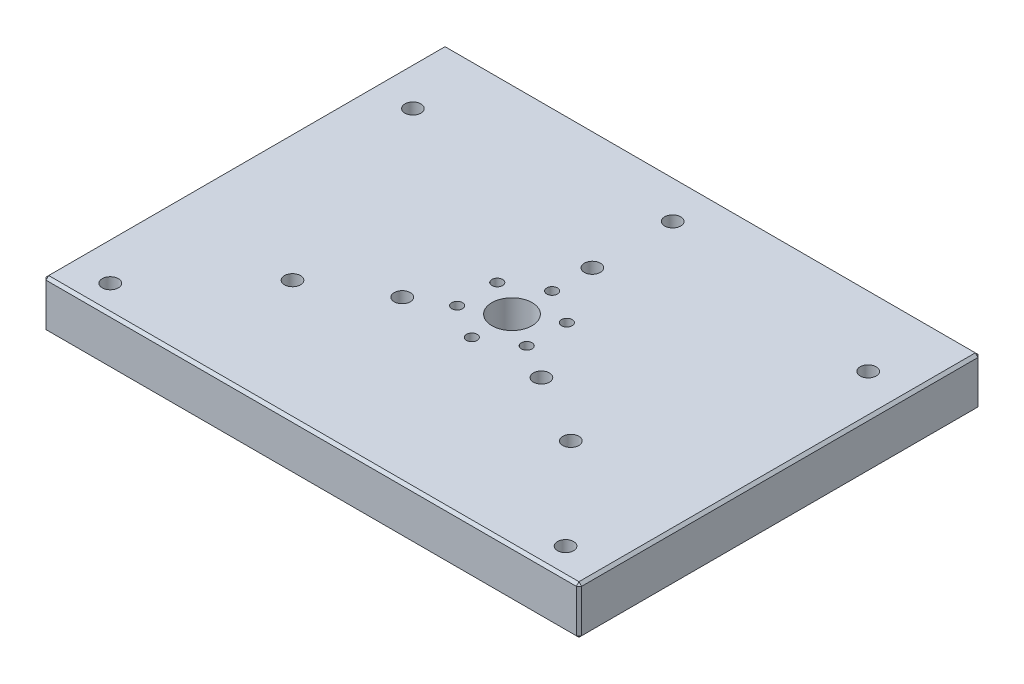
ISO-10303-21;
HEADER;
FILE_DESCRIPTION(('STEP AP214'),'2;1');
FILE_NAME('part.step','',(''),(''),'','','');
FILE_SCHEMA(('AUTOMOTIVE_DESIGN { 1 0 10303 214 1 1 1 1 }'));
ENDSEC;
DATA;
#1=APPLICATION_CONTEXT('core data for automotive mechanical design processes');
#2=APPLICATION_PROTOCOL_DEFINITION('international standard','automotive_design',2000,#1);
#3=PRODUCT_CONTEXT('',#1,'mechanical');
#4=PRODUCT('Part','Part','',(#3));
#5=PRODUCT_RELATED_PRODUCT_CATEGORY('part','',(#4));
#6=PRODUCT_DEFINITION_FORMATION('','',#4);
#7=PRODUCT_DEFINITION_CONTEXT('part definition',#1,'design');
#8=PRODUCT_DEFINITION('design','',#6,#7);
#9=PRODUCT_DEFINITION_SHAPE('','',#8);
#10=(LENGTH_UNIT() NAMED_UNIT(*) SI_UNIT(.MILLI.,.METRE.));
#11=(NAMED_UNIT(*) PLANE_ANGLE_UNIT() SI_UNIT($,.RADIAN.));
#12=(NAMED_UNIT(*) SI_UNIT($,.STERADIAN.) SOLID_ANGLE_UNIT());
#13=UNCERTAINTY_MEASURE_WITH_UNIT(LENGTH_MEASURE(1.E-05),#10,'distance_accuracy_value','');
#14=(GEOMETRIC_REPRESENTATION_CONTEXT(3) GLOBAL_UNCERTAINTY_ASSIGNED_CONTEXT((#13)) GLOBAL_UNIT_ASSIGNED_CONTEXT((#10,
#11,#12)) REPRESENTATION_CONTEXT('',''));
#15=CARTESIAN_POINT('',(0.,0.,0.));
#16=DIRECTION('',(0.,0.,1.));
#17=DIRECTION('',(1.,0.,0.));
#18=AXIS2_PLACEMENT_3D('',#15,#16,#17);
#19=CARTESIAN_POINT('',(100.,-10.,-75.));
#20=DIRECTION('',(1.,0.,0.));
#21=DIRECTION('',(0.,0.,-1.));
#22=AXIS2_PLACEMENT_3D('',#19,#20,#21);
#23=PLANE('',#22);
#24=DIRECTION('',(0.,0.,-1.));
#25=VECTOR('',#24,1.);
#26=CARTESIAN_POINT('',(100.,-9.,-75.));
#27=LINE('',#26,#25);
#28=CARTESIAN_POINT('',(100.,-9.,74.));
#29=VERTEX_POINT('',#28);
#30=CARTESIAN_POINT('',(100.,-9.,-74.));
#31=VERTEX_POINT('',#30);
#32=EDGE_CURVE('E135',#29,#31,#27,.T.);
#33=ORIENTED_EDGE('',*,*,#32,.T.);
#34=DIRECTION('',(0.,1.,0.));
#35=VECTOR('',#34,1.);
#36=CARTESIAN_POINT('',(100.,-10.,-74.));
#37=LINE('',#36,#35);
#38=CARTESIAN_POINT('',(100.,7.,-74.));
#39=VERTEX_POINT('',#38);
#40=EDGE_CURVE('E131',#31,#39,#37,.T.);
#41=ORIENTED_EDGE('',*,*,#40,.T.);
#42=DIRECTION('',(0.,0.,1.));
#43=VECTOR('',#42,1.);
#44=CARTESIAN_POINT('',(100.,7.,-75.));
#45=LINE('',#44,#43);
#46=CARTESIAN_POINT('',(100.,7.,74.));
#47=VERTEX_POINT('',#46);
#48=EDGE_CURVE('E126',#39,#47,#45,.T.);
#49=ORIENTED_EDGE('',*,*,#48,.T.);
#50=DIRECTION('',(0.,-1.,0.));
#51=VECTOR('',#50,1.);
#52=CARTESIAN_POINT('',(100.,-10.,74.));
#53=LINE('',#52,#51);
#54=EDGE_CURVE('E128',#47,#29,#53,.T.);
#55=ORIENTED_EDGE('',*,*,#54,.T.);
#56=EDGE_LOOP('',(#33,#41,#49,#55));
#57=FACE_BOUND('',#56,.T.);
#58=ADVANCED_FACE('F37',(#57),#23,.T.);
#59=CARTESIAN_POINT('',(-100.,-10.,75.));
#60=DIRECTION('',(0.,0.,1.));
#61=DIRECTION('',(1.,0.,0.));
#62=AXIS2_PLACEMENT_3D('',#59,#60,#61);
#63=PLANE('',#62);
#64=DIRECTION('',(1.,0.,0.));
#65=VECTOR('',#64,1.);
#66=CARTESIAN_POINT('',(100.,-9.,75.));
#67=LINE('',#66,#65);
#68=CARTESIAN_POINT('',(-99.,-9.,75.));
#69=VERTEX_POINT('',#68);
#70=CARTESIAN_POINT('',(99.,-9.,75.));
#71=VERTEX_POINT('',#70);
#72=EDGE_CURVE('E344',#69,#71,#67,.T.);
#73=ORIENTED_EDGE('',*,*,#72,.T.);
#74=DIRECTION('',(0.,1.,0.));
#75=VECTOR('',#74,1.);
#76=CARTESIAN_POINT('',(99.,-10.,75.));
#77=LINE('',#76,#75);
#78=CARTESIAN_POINT('',(99.,7.,75.));
#79=VERTEX_POINT('',#78);
#80=EDGE_CURVE('E346',#71,#79,#77,.T.);
#81=ORIENTED_EDGE('',*,*,#80,.T.);
#82=DIRECTION('',(-1.,0.,0.));
#83=VECTOR('',#82,1.);
#84=CARTESIAN_POINT('',(-100.,7.,75.));
#85=LINE('',#84,#83);
#86=CARTESIAN_POINT('',(-99.,7.,75.));
#87=VERTEX_POINT('',#86);
#88=EDGE_CURVE('E342',#79,#87,#85,.T.);
#89=ORIENTED_EDGE('',*,*,#88,.T.);
#90=DIRECTION('',(0.,-1.,0.));
#91=VECTOR('',#90,1.);
#92=CARTESIAN_POINT('',(-99.,-10.,75.));
#93=LINE('',#92,#91);
#94=EDGE_CURVE('E340',#87,#69,#93,.T.);
#95=ORIENTED_EDGE('',*,*,#94,.T.);
#96=EDGE_LOOP('',(#73,#81,#89,#95));
#97=FACE_BOUND('',#96,.T.);
#98=ADVANCED_FACE('F400',(#97),#63,.T.);
#99=CARTESIAN_POINT('',(-100.,-10.,-75.));
#100=DIRECTION('',(-1.,0.,0.));
#101=DIRECTION('',(0.,0.,1.));
#102=AXIS2_PLACEMENT_3D('',#99,#100,#101);
#103=PLANE('',#102);
#104=DIRECTION('',(0.,0.,1.));
#105=VECTOR('',#104,1.);
#106=CARTESIAN_POINT('',(-100.,-9.,75.));
#107=LINE('',#106,#105);
#108=CARTESIAN_POINT('',(-100.,-9.,-74.));
#109=VERTEX_POINT('',#108);
#110=CARTESIAN_POINT('',(-100.,-9.,74.));
#111=VERTEX_POINT('',#110);
#112=EDGE_CURVE('E349',#109,#111,#107,.T.);
#113=ORIENTED_EDGE('',*,*,#112,.T.);
#114=DIRECTION('',(0.,1.,0.));
#115=VECTOR('',#114,1.);
#116=CARTESIAN_POINT('',(-100.,-10.,74.));
#117=LINE('',#116,#115);
#118=CARTESIAN_POINT('',(-100.,7.,74.));
#119=VERTEX_POINT('',#118);
#120=EDGE_CURVE('E11',#111,#119,#117,.T.);
#121=ORIENTED_EDGE('',*,*,#120,.T.);
#122=DIRECTION('',(0.,0.,-1.));
#123=VECTOR('',#122,1.);
#124=CARTESIAN_POINT('',(-100.,7.,-75.));
#125=LINE('',#124,#123);
#126=CARTESIAN_POINT('',(-100.,7.,-74.));
#127=VERTEX_POINT('',#126);
#128=EDGE_CURVE('E46',#119,#127,#125,.T.);
#129=ORIENTED_EDGE('',*,*,#128,.T.);
#130=DIRECTION('',(0.,-1.,0.));
#131=VECTOR('',#130,1.);
#132=CARTESIAN_POINT('',(-100.,-10.,-74.));
#133=LINE('',#132,#131);
#134=EDGE_CURVE('E351',#127,#109,#133,.T.);
#135=ORIENTED_EDGE('',*,*,#134,.T.);
#136=EDGE_LOOP('',(#113,#121,#129,#135));
#137=FACE_BOUND('',#136,.T.);
#138=ADVANCED_FACE('F443',(#137),#103,.T.);
#139=CARTESIAN_POINT('',(-100.,-10.,-75.));
#140=DIRECTION('',(0.,0.,-1.));
#141=DIRECTION('',(-1.,0.,0.));
#142=AXIS2_PLACEMENT_3D('',#139,#140,#141);
#143=PLANE('',#142);
#144=DIRECTION('',(1.,0.,0.));
#145=VECTOR('',#144,1.);
#146=CARTESIAN_POINT('',(-100.,7.,-75.));
#147=LINE('',#146,#145);
#148=CARTESIAN_POINT('',(-99.,7.,-75.));
#149=VERTEX_POINT('',#148);
#150=CARTESIAN_POINT('',(99.,7.,-75.));
#151=VERTEX_POINT('',#150);
#152=EDGE_CURVE('E319',#149,#151,#147,.T.);
#153=ORIENTED_EDGE('',*,*,#152,.T.);
#154=DIRECTION('',(0.,-1.,0.));
#155=VECTOR('',#154,1.);
#156=CARTESIAN_POINT('',(99.,-10.,-75.));
#157=LINE('',#156,#155);
#158=CARTESIAN_POINT('',(99.,-9.,-75.));
#159=VERTEX_POINT('',#158);
#160=EDGE_CURVE('E321',#151,#159,#157,.T.);
#161=ORIENTED_EDGE('',*,*,#160,.T.);
#162=DIRECTION('',(-1.,0.,0.));
#163=VECTOR('',#162,1.);
#164=CARTESIAN_POINT('',(-100.,-9.,-75.));
#165=LINE('',#164,#163);
#166=CARTESIAN_POINT('',(-99.,-9.,-75.));
#167=VERTEX_POINT('',#166);
#168=EDGE_CURVE('E315',#159,#167,#165,.T.);
#169=ORIENTED_EDGE('',*,*,#168,.T.);
#170=DIRECTION('',(0.,1.,0.));
#171=VECTOR('',#170,1.);
#172=CARTESIAN_POINT('',(-99.,-10.,-75.));
#173=LINE('',#172,#171);
#174=EDGE_CURVE('E317',#167,#149,#173,.T.);
#175=ORIENTED_EDGE('',*,*,#174,.T.);
#176=EDGE_LOOP('',(#153,#161,#169,#175));
#177=FACE_BOUND('',#176,.T.);
#178=ADVANCED_FACE('F379',(#177),#143,.T.);
#179=CARTESIAN_POINT('',(0.,-10.,0.));
#180=DIRECTION('',(0.,1.,0.));
#181=DIRECTION('',(0.,0.,1.));
#182=AXIS2_PLACEMENT_3D('',#179,#180,#181);
#183=PLANE('',#182);
#184=DIRECTION('',(1.,0.,0.));
#185=VECTOR('',#184,1.);
#186=CARTESIAN_POINT('',(100.,-10.,-74.));
#187=LINE('',#186,#185);
#188=CARTESIAN_POINT('',(-99.,-10.,-74.));
#189=VERTEX_POINT('',#188);
#190=CARTESIAN_POINT('',(99.,-10.,-74.));
#191=VERTEX_POINT('',#190);
#192=EDGE_CURVE('E326',#189,#191,#187,.T.);
#193=ORIENTED_EDGE('',*,*,#192,.T.);
#194=DIRECTION('',(0.,0.,1.));
#195=VECTOR('',#194,1.);
#196=CARTESIAN_POINT('',(99.,-10.,75.));
#197=LINE('',#196,#195);
#198=CARTESIAN_POINT('',(99.,-10.,74.));
#199=VERTEX_POINT('',#198);
#200=EDGE_CURVE('E330',#191,#199,#197,.T.);
#201=ORIENTED_EDGE('',*,*,#200,.T.);
#202=DIRECTION('',(-1.,0.,0.));
#203=VECTOR('',#202,1.);
#204=CARTESIAN_POINT('',(-100.,-10.,74.));
#205=LINE('',#204,#203);
#206=CARTESIAN_POINT('',(-99.,-10.,74.));
#207=VERTEX_POINT('',#206);
#208=EDGE_CURVE('E328',#199,#207,#205,.T.);
#209=ORIENTED_EDGE('',*,*,#208,.T.);
#210=DIRECTION('',(0.,0.,-1.));
#211=VECTOR('',#210,1.);
#212=CARTESIAN_POINT('',(-99.,-10.,-75.));
#213=LINE('',#212,#211);
#214=EDGE_CURVE('E324',#207,#189,#213,.T.);
#215=ORIENTED_EDGE('',*,*,#214,.T.);
#216=EDGE_LOOP('',(#193,#201,#209,#215));
#217=FACE_BOUND('',#216,.T.);
#218=CARTESIAN_POINT('',(8.39606162372775E-13,-10.,-60.));
#219=DIRECTION('',(0.,1.,0.));
#220=DIRECTION('',(0.,0.,1.));
#221=AXIS2_PLACEMENT_3D('',#218,#219,#220);
#222=CIRCLE('',#221,3.);
#223=CARTESIAN_POINT('',(8.39606162372775E-13,-10.,-57.));
#224=VERTEX_POINT('',#223);
#225=EDGE_CURVE('E211',#224,#224,#222,.T.);
#226=ORIENTED_EDGE('',*,*,#225,.T.);
#227=EDGE_LOOP('',(#226));
#228=FACE_BOUND('',#227,.T.);
#229=CARTESIAN_POINT('',(-85.,-10.,-48.));
#230=DIRECTION('',(0.,1.,0.));
#231=DIRECTION('',(0.,0.,-1.));
#232=AXIS2_PLACEMENT_3D('',#229,#230,#231);
#233=CIRCLE('',#232,3.00000000000001);
#234=CARTESIAN_POINT('',(-85.,-10.,-51.));
#235=VERTEX_POINT('',#234);
#236=EDGE_CURVE('E216',#235,#235,#233,.T.);
#237=ORIENTED_EDGE('',*,*,#236,.T.);
#238=EDGE_LOOP('',(#237));
#239=FACE_BOUND('',#238,.T.);
#240=CARTESIAN_POINT('',(-85.,-10.,65.));
#241=DIRECTION('',(0.,1.,0.));
#242=DIRECTION('',(0.,0.,-1.));
#243=AXIS2_PLACEMENT_3D('',#240,#241,#242);
#244=CIRCLE('',#243,3.00000000000001);
#245=CARTESIAN_POINT('',(-85.,-10.,62.));
#246=VERTEX_POINT('',#245);
#247=EDGE_CURVE('E223',#246,#246,#244,.T.);
#248=ORIENTED_EDGE('',*,*,#247,.T.);
#249=EDGE_LOOP('',(#248));
#250=FACE_BOUND('',#249,.T.);
#251=CARTESIAN_POINT('',(-51.9615242270666,-10.,29.9999999999995));
#252=DIRECTION('',(0.,1.,0.));
#253=DIRECTION('',(0.,0.,1.));
#254=AXIS2_PLACEMENT_3D('',#251,#252,#253);
#255=CIRCLE('',#254,2.99999999999999);
#256=CARTESIAN_POINT('',(-51.9615242270666,-10.,32.9999999999995));
#257=VERTEX_POINT('',#256);
#258=EDGE_CURVE('E219',#257,#257,#255,.T.);
#259=ORIENTED_EDGE('',*,*,#258,.T.);
#260=EDGE_LOOP('',(#259));
#261=FACE_BOUND('',#260,.T.);
#262=CARTESIAN_POINT('',(85.,-10.,65.));
#263=DIRECTION('',(0.,1.,0.));
#264=DIRECTION('',(0.,0.,1.));
#265=AXIS2_PLACEMENT_3D('',#262,#263,#264);
#266=CIRCLE('',#265,3.00000000000001);
#267=CARTESIAN_POINT('',(85.,-10.,68.));
#268=VERTEX_POINT('',#267);
#269=EDGE_CURVE('E222',#268,#268,#266,.T.);
#270=ORIENTED_EDGE('',*,*,#269,.T.);
#271=EDGE_LOOP('',(#270));
#272=FACE_BOUND('',#271,.T.);
#273=CARTESIAN_POINT('',(25.980762113533,-10.,15.0000000000002));
#274=DIRECTION('',(0.,1.,0.));
#275=DIRECTION('',(0.,0.,1.));
#276=AXIS2_PLACEMENT_3D('',#273,#274,#275);
#277=CIRCLE('',#276,2.99999999999999);
#278=CARTESIAN_POINT('',(25.980762113533,-10.,18.0000000000002));
#279=VERTEX_POINT('',#278);
#280=EDGE_CURVE('E235',#279,#279,#277,.T.);
#281=ORIENTED_EDGE('',*,*,#280,.T.);
#282=EDGE_LOOP('',(#281));
#283=FACE_BOUND('',#282,.T.);
#284=CARTESIAN_POINT('',(2.7580761951353E-13,-10.,-30.));
#285=DIRECTION('',(0.,1.,0.));
#286=DIRECTION('',(0.,0.,1.));
#287=AXIS2_PLACEMENT_3D('',#284,#285,#286);
#288=CIRCLE('',#287,2.99999999999999);
#289=CARTESIAN_POINT('',(2.7580761951353E-13,-10.,-27.));
#290=VERTEX_POINT('',#289);
#291=EDGE_CURVE('E232',#290,#290,#288,.T.);
#292=ORIENTED_EDGE('',*,*,#291,.T.);
#293=EDGE_LOOP('',(#292));
#294=FACE_BOUND('',#293,.T.);
#295=CARTESIAN_POINT('',(-25.9807621135333,-10.,14.9999999999998));
#296=DIRECTION('',(0.,1.,0.));
#297=DIRECTION('',(0.,0.,1.));
#298=AXIS2_PLACEMENT_3D('',#295,#296,#297);
#299=CIRCLE('',#298,2.99999999999999);
#300=CARTESIAN_POINT('',(-25.9807621135333,-10.,17.9999999999998));
#301=VERTEX_POINT('',#300);
#302=EDGE_CURVE('E228',#301,#301,#299,.T.);
#303=ORIENTED_EDGE('',*,*,#302,.T.);
#304=EDGE_LOOP('',(#303));
#305=FACE_BOUND('',#304,.T.);
#306=CARTESIAN_POINT('',(51.9615242270658,-10.,30.000000000001));
#307=DIRECTION('',(0.,1.,0.));
#308=DIRECTION('',(0.,0.,1.));
#309=AXIS2_PLACEMENT_3D('',#306,#307,#308);
#310=CIRCLE('',#309,3.);
#311=CARTESIAN_POINT('',(51.9615242270658,-10.,33.000000000001));
#312=VERTEX_POINT('',#311);
#313=EDGE_CURVE('E205',#312,#312,#310,.T.);
#314=ORIENTED_EDGE('',*,*,#313,.T.);
#315=EDGE_LOOP('',(#314));
#316=FACE_BOUND('',#315,.T.);
#317=CARTESIAN_POINT('',(85.,-10.,-48.));
#318=DIRECTION('',(0.,1.,0.));
#319=DIRECTION('',(0.,0.,1.));
#320=AXIS2_PLACEMENT_3D('',#317,#318,#319);
#321=CIRCLE('',#320,3.00000000000001);
#322=CARTESIAN_POINT('',(85.,-10.,-45.));
#323=VERTEX_POINT('',#322);
#324=EDGE_CURVE('E231',#323,#323,#321,.T.);
#325=ORIENTED_EDGE('',*,*,#324,.T.);
#326=EDGE_LOOP('',(#325));
#327=FACE_BOUND('',#326,.T.);
#328=CARTESIAN_POINT('',(-12.9903810567665,-10.,-7.50000000000015));
#329=DIRECTION('',(0.,1.,0.));
#330=DIRECTION('',(0.,0.,1.));
#331=AXIS2_PLACEMENT_3D('',#328,#329,#330);
#332=CIRCLE('',#331,2.);
#333=CARTESIAN_POINT('',(-12.9903810567665,-10.,-5.50000000000015));
#334=VERTEX_POINT('',#333);
#335=EDGE_CURVE('E265',#334,#334,#332,.T.);
#336=ORIENTED_EDGE('',*,*,#335,.T.);
#337=EDGE_LOOP('',(#336));
#338=FACE_BOUND('',#337,.T.);
#339=CARTESIAN_POINT('',(-12.9903810567667,-10.,7.49999999999988));
#340=DIRECTION('',(0.,1.,0.));
#341=DIRECTION('',(0.,0.,1.));
#342=AXIS2_PLACEMENT_3D('',#339,#340,#341);
#343=CIRCLE('',#342,2.);
#344=CARTESIAN_POINT('',(-12.9903810567667,-10.,9.49999999999988));
#345=VERTEX_POINT('',#344);
#346=EDGE_CURVE('E268',#345,#345,#343,.T.);
#347=ORIENTED_EDGE('',*,*,#346,.T.);
#348=EDGE_LOOP('',(#347));
#349=FACE_BOUND('',#348,.T.);
#350=CARTESIAN_POINT('',(-1.04744440165294E-13,-10.,15.));
#351=DIRECTION('',(0.,1.,0.));
#352=DIRECTION('',(0.,0.,1.));
#353=AXIS2_PLACEMENT_3D('',#350,#351,#352);
#354=CIRCLE('',#353,2.);
#355=CARTESIAN_POINT('',(-1.04744440165294E-13,-10.,17.));
#356=VERTEX_POINT('',#355);
#357=EDGE_CURVE('E271',#356,#356,#354,.T.);
#358=ORIENTED_EDGE('',*,*,#357,.T.);
#359=EDGE_LOOP('',(#358));
#360=FACE_BOUND('',#359,.T.);
#361=CARTESIAN_POINT('',(12.9903810567665,-10.,7.50000000000006));
#362=DIRECTION('',(0.,1.,0.));
#363=DIRECTION('',(0.,0.,1.));
#364=AXIS2_PLACEMENT_3D('',#361,#362,#363);
#365=CIRCLE('',#364,2.);
#366=CARTESIAN_POINT('',(12.9903810567665,-10.,9.50000000000006));
#367=VERTEX_POINT('',#366);
#368=EDGE_CURVE('E274',#367,#367,#365,.T.);
#369=ORIENTED_EDGE('',*,*,#368,.T.);
#370=EDGE_LOOP('',(#369));
#371=FACE_BOUND('',#370,.T.);
#372=CARTESIAN_POINT('',(12.9903810567666,-10.,-7.49999999999997));
#373=DIRECTION('',(0.,1.,0.));
#374=DIRECTION('',(0.,0.,1.));
#375=AXIS2_PLACEMENT_3D('',#372,#373,#374);
#376=CIRCLE('',#375,2.);
#377=CARTESIAN_POINT('',(12.9903810567666,-10.,-5.49999999999997));
#378=VERTEX_POINT('',#377);
#379=EDGE_CURVE('E277',#378,#378,#376,.T.);
#380=ORIENTED_EDGE('',*,*,#379,.T.);
#381=EDGE_LOOP('',(#380));
#382=FACE_BOUND('',#381,.T.);
#383=CARTESIAN_POINT('',(0.,-10.,-15.));
#384=DIRECTION('',(0.,1.,0.));
#385=DIRECTION('',(0.,0.,1.));
#386=AXIS2_PLACEMENT_3D('',#383,#384,#385);
#387=CIRCLE('',#386,2.);
#388=CARTESIAN_POINT('',(0.,-10.,-13.));
#389=VERTEX_POINT('',#388);
#390=EDGE_CURVE('E280',#389,#389,#387,.T.);
#391=ORIENTED_EDGE('',*,*,#390,.T.);
#392=EDGE_LOOP('',(#391));
#393=FACE_BOUND('',#392,.T.);
#394=CARTESIAN_POINT('',(0.,-10.,0.));
#395=DIRECTION('',(0.,1.,0.));
#396=DIRECTION('',(0.,0.,1.));
#397=AXIS2_PLACEMENT_3D('',#394,#395,#396);
#398=CIRCLE('',#397,7.5);
#399=CARTESIAN_POINT('',(0.,-10.,7.50000000000001));
#400=VERTEX_POINT('',#399);
#401=EDGE_CURVE('E147',#400,#400,#398,.T.);
#402=ORIENTED_EDGE('',*,*,#401,.T.);
#403=EDGE_LOOP('',(#402));
#404=FACE_BOUND('',#403,.T.);
#405=ADVANCED_FACE('F413',(#217,#228,#239,#250,#261,#272,#283,#294,#305,#316,#327,#338,#349,
#360,#371,#382,#393,#404),#183,.F.);
#406=CARTESIAN_POINT('',(0.,-10.,0.));
#407=DIRECTION('',(0.,1.,0.));
#408=DIRECTION('',(0.,0.,1.));
#409=AXIS2_PLACEMENT_3D('',#406,#407,#408);
#410=CYLINDRICAL_SURFACE('',#409,7.5);
#411=ORIENTED_EDGE('',*,*,#401,.F.);
#412=EDGE_LOOP('',(#411));
#413=FACE_BOUND('',#412,.T.);
#414=CARTESIAN_POINT('',(0.,8.,0.));
#415=DIRECTION('',(0.,1.,0.));
#416=DIRECTION('',(0.,0.,1.));
#417=AXIS2_PLACEMENT_3D('',#414,#415,#416);
#418=CIRCLE('',#417,7.5);
#419=CARTESIAN_POINT('',(0.,8.,7.50000000000001));
#420=VERTEX_POINT('',#419);
#421=EDGE_CURVE('E262',#420,#420,#418,.T.);
#422=ORIENTED_EDGE('',*,*,#421,.T.);
#423=EDGE_LOOP('',(#422));
#424=FACE_BOUND('',#423,.T.);
#425=ADVANCED_FACE('F747',(#413,#424),#410,.F.);
#426=CARTESIAN_POINT('',(0.,-10.,-15.));
#427=DIRECTION('',(0.,1.,0.));
#428=DIRECTION('',(0.,0.,1.));
#429=AXIS2_PLACEMENT_3D('',#426,#427,#428);
#430=CYLINDRICAL_SURFACE('',#429,2.);
#431=ORIENTED_EDGE('',*,*,#390,.F.);
#432=EDGE_LOOP('',(#431));
#433=FACE_BOUND('',#432,.T.);
#434=CARTESIAN_POINT('',(0.,8.,-15.));
#435=DIRECTION('',(0.,1.,0.));
#436=DIRECTION('',(0.,0.,1.));
#437=AXIS2_PLACEMENT_3D('',#434,#435,#436);
#438=CIRCLE('',#437,2.);
#439=CARTESIAN_POINT('',(0.,8.,-13.));
#440=VERTEX_POINT('',#439);
#441=EDGE_CURVE('E259',#440,#440,#438,.T.);
#442=ORIENTED_EDGE('',*,*,#441,.T.);
#443=EDGE_LOOP('',(#442));
#444=FACE_BOUND('',#443,.T.);
#445=ADVANCED_FACE('F738',(#433,#444),#430,.F.);
#446=CARTESIAN_POINT('',(12.9903810567666,-10.,-7.49999999999997));
#447=DIRECTION('',(0.,1.,0.));
#448=DIRECTION('',(0.,0.,1.));
#449=AXIS2_PLACEMENT_3D('',#446,#447,#448);
#450=CYLINDRICAL_SURFACE('',#449,2.);
#451=ORIENTED_EDGE('',*,*,#379,.F.);
#452=EDGE_LOOP('',(#451));
#453=FACE_BOUND('',#452,.T.);
#454=CARTESIAN_POINT('',(12.9903810567666,8.,-7.49999999999997));
#455=DIRECTION('',(0.,1.,0.));
#456=DIRECTION('',(0.,0.,1.));
#457=AXIS2_PLACEMENT_3D('',#454,#455,#456);
#458=CIRCLE('',#457,2.);
#459=CARTESIAN_POINT('',(12.9903810567666,8.,-5.49999999999997));
#460=VERTEX_POINT('',#459);
#461=EDGE_CURVE('E256',#460,#460,#458,.T.);
#462=ORIENTED_EDGE('',*,*,#461,.T.);
#463=EDGE_LOOP('',(#462));
#464=FACE_BOUND('',#463,.T.);
#465=ADVANCED_FACE('F729',(#453,#464),#450,.F.);
#466=CARTESIAN_POINT('',(12.9903810567665,-10.,7.50000000000006));
#467=DIRECTION('',(0.,1.,0.));
#468=DIRECTION('',(0.,0.,1.));
#469=AXIS2_PLACEMENT_3D('',#466,#467,#468);
#470=CYLINDRICAL_SURFACE('',#469,2.);
#471=ORIENTED_EDGE('',*,*,#368,.F.);
#472=EDGE_LOOP('',(#471));
#473=FACE_BOUND('',#472,.T.);
#474=CARTESIAN_POINT('',(12.9903810567665,8.,7.50000000000006));
#475=DIRECTION('',(0.,1.,0.));
#476=DIRECTION('',(0.,0.,1.));
#477=AXIS2_PLACEMENT_3D('',#474,#475,#476);
#478=CIRCLE('',#477,2.);
#479=CARTESIAN_POINT('',(12.9903810567665,8.,9.50000000000006));
#480=VERTEX_POINT('',#479);
#481=EDGE_CURVE('E253',#480,#480,#478,.T.);
#482=ORIENTED_EDGE('',*,*,#481,.T.);
#483=EDGE_LOOP('',(#482));
#484=FACE_BOUND('',#483,.T.);
#485=ADVANCED_FACE('F720',(#473,#484),#470,.F.);
#486=CARTESIAN_POINT('',(-1.04744440165294E-13,-10.,15.));
#487=DIRECTION('',(0.,1.,0.));
#488=DIRECTION('',(0.,0.,1.));
#489=AXIS2_PLACEMENT_3D('',#486,#487,#488);
#490=CYLINDRICAL_SURFACE('',#489,2.);
#491=ORIENTED_EDGE('',*,*,#357,.F.);
#492=EDGE_LOOP('',(#491));
#493=FACE_BOUND('',#492,.T.);
#494=CARTESIAN_POINT('',(-1.04744440165294E-13,8.,15.));
#495=DIRECTION('',(0.,1.,0.));
#496=DIRECTION('',(0.,0.,1.));
#497=AXIS2_PLACEMENT_3D('',#494,#495,#496);
#498=CIRCLE('',#497,2.);
#499=CARTESIAN_POINT('',(-1.04744440165294E-13,8.,17.));
#500=VERTEX_POINT('',#499);
#501=EDGE_CURVE('E250',#500,#500,#498,.T.);
#502=ORIENTED_EDGE('',*,*,#501,.T.);
#503=EDGE_LOOP('',(#502));
#504=FACE_BOUND('',#503,.T.);
#505=ADVANCED_FACE('F711',(#493,#504),#490,.F.);
#506=CARTESIAN_POINT('',(-12.9903810567667,-10.,7.49999999999988));
#507=DIRECTION('',(0.,1.,0.));
#508=DIRECTION('',(0.,0.,1.));
#509=AXIS2_PLACEMENT_3D('',#506,#507,#508);
#510=CYLINDRICAL_SURFACE('',#509,2.);
#511=ORIENTED_EDGE('',*,*,#346,.F.);
#512=EDGE_LOOP('',(#511));
#513=FACE_BOUND('',#512,.T.);
#514=CARTESIAN_POINT('',(-12.9903810567667,8.,7.49999999999988));
#515=DIRECTION('',(0.,1.,0.));
#516=DIRECTION('',(0.,0.,1.));
#517=AXIS2_PLACEMENT_3D('',#514,#515,#516);
#518=CIRCLE('',#517,2.);
#519=CARTESIAN_POINT('',(-12.9903810567667,8.,9.49999999999988));
#520=VERTEX_POINT('',#519);
#521=EDGE_CURVE('E246',#520,#520,#518,.T.);
#522=ORIENTED_EDGE('',*,*,#521,.T.);
#523=EDGE_LOOP('',(#522));
#524=FACE_BOUND('',#523,.T.);
#525=ADVANCED_FACE('F702',(#513,#524),#510,.F.);
#526=CARTESIAN_POINT('',(-12.9903810567665,-10.,-7.50000000000015));
#527=DIRECTION('',(0.,1.,0.));
#528=DIRECTION('',(0.,0.,1.));
#529=AXIS2_PLACEMENT_3D('',#526,#527,#528);
#530=CYLINDRICAL_SURFACE('',#529,2.);
#531=ORIENTED_EDGE('',*,*,#335,.F.);
#532=EDGE_LOOP('',(#531));
#533=FACE_BOUND('',#532,.T.);
#534=CARTESIAN_POINT('',(-12.9903810567665,8.,-7.50000000000015));
#535=DIRECTION('',(0.,1.,0.));
#536=DIRECTION('',(0.,0.,1.));
#537=AXIS2_PLACEMENT_3D('',#534,#535,#536);
#538=CIRCLE('',#537,2.);
#539=CARTESIAN_POINT('',(-12.9903810567665,8.,-5.50000000000015));
#540=VERTEX_POINT('',#539);
#541=EDGE_CURVE('E243',#540,#540,#538,.T.);
#542=ORIENTED_EDGE('',*,*,#541,.T.);
#543=EDGE_LOOP('',(#542));
#544=FACE_BOUND('',#543,.T.);
#545=ADVANCED_FACE('F694',(#533,#544),#530,.F.);
#546=CARTESIAN_POINT('',(0.,8.,0.));
#547=DIRECTION('',(0.,1.,0.));
#548=DIRECTION('',(0.,0.,1.));
#549=AXIS2_PLACEMENT_3D('',#546,#547,#548);
#550=PLANE('',#549);
#551=DIRECTION('',(1.,0.,0.));
#552=VECTOR('',#551,1.);
#553=CARTESIAN_POINT('',(0.,8.,74.));
#554=LINE('',#553,#552);
#555=CARTESIAN_POINT('',(-99.,8.,74.));
#556=VERTEX_POINT('',#555);
#557=CARTESIAN_POINT('',(99.,8.,74.));
#558=VERTEX_POINT('',#557);
#559=EDGE_CURVE('E337',#556,#558,#554,.T.);
#560=ORIENTED_EDGE('',*,*,#559,.T.);
#561=DIRECTION('',(0.,0.,-1.));
#562=VECTOR('',#561,1.);
#563=CARTESIAN_POINT('',(99.,8.,0.));
#564=LINE('',#563,#562);
#565=CARTESIAN_POINT('',(99.,8.,-74.));
#566=VERTEX_POINT('',#565);
#567=EDGE_CURVE('E159',#558,#566,#564,.T.);
#568=ORIENTED_EDGE('',*,*,#567,.T.);
#569=DIRECTION('',(-1.,0.,0.));
#570=VECTOR('',#569,1.);
#571=CARTESIAN_POINT('',(0.,8.,-74.));
#572=LINE('',#571,#570);
#573=CARTESIAN_POINT('',(-99.,8.,-74.));
#574=VERTEX_POINT('',#573);
#575=EDGE_CURVE('E333',#566,#574,#572,.T.);
#576=ORIENTED_EDGE('',*,*,#575,.T.);
#577=DIRECTION('',(0.,0.,1.));
#578=VECTOR('',#577,1.);
#579=CARTESIAN_POINT('',(-99.,8.,0.));
#580=LINE('',#579,#578);
#581=EDGE_CURVE('E335',#574,#556,#580,.T.);
#582=ORIENTED_EDGE('',*,*,#581,.T.);
#583=EDGE_LOOP('',(#560,#568,#576,#582));
#584=FACE_BOUND('',#583,.T.);
#585=CARTESIAN_POINT('',(8.39606162372775E-13,8.,-60.));
#586=DIRECTION('',(0.,1.,0.));
#587=DIRECTION('',(0.,0.,1.));
#588=AXIS2_PLACEMENT_3D('',#585,#586,#587);
#589=CIRCLE('',#588,3.);
#590=CARTESIAN_POINT('',(8.39606162372775E-13,8.,-57.));
#591=VERTEX_POINT('',#590);
#592=EDGE_CURVE('E247',#591,#591,#589,.F.);
#593=ORIENTED_EDGE('',*,*,#592,.T.);
#594=EDGE_LOOP('',(#593));
#595=FACE_BOUND('',#594,.T.);
#596=CARTESIAN_POINT('',(-85.,8.,-48.));
#597=DIRECTION('',(0.,1.,0.));
#598=DIRECTION('',(0.,0.,1.));
#599=AXIS2_PLACEMENT_3D('',#596,#597,#598);
#600=CIRCLE('',#599,3.00000000000001);
#601=CARTESIAN_POINT('',(-85.,8.,-45.));
#602=VERTEX_POINT('',#601);
#603=EDGE_CURVE('E308',#602,#602,#600,.F.);
#604=ORIENTED_EDGE('',*,*,#603,.T.);
#605=EDGE_LOOP('',(#604));
#606=FACE_BOUND('',#605,.T.);
#607=CARTESIAN_POINT('',(-85.,8.,65.));
#608=DIRECTION('',(0.,1.,0.));
#609=DIRECTION('',(0.,0.,1.));
#610=AXIS2_PLACEMENT_3D('',#607,#608,#609);
#611=CIRCLE('',#610,3.00000000000001);
#612=CARTESIAN_POINT('',(-85.,8.,68.));
#613=VERTEX_POINT('',#612);
#614=EDGE_CURVE('E305',#613,#613,#611,.F.);
#615=ORIENTED_EDGE('',*,*,#614,.T.);
#616=EDGE_LOOP('',(#615));
#617=FACE_BOUND('',#616,.T.);
#618=CARTESIAN_POINT('',(-51.9615242270666,8.,29.9999999999995));
#619=DIRECTION('',(0.,1.,0.));
#620=DIRECTION('',(0.,0.,1.));
#621=AXIS2_PLACEMENT_3D('',#618,#619,#620);
#622=CIRCLE('',#621,2.99999999999999);
#623=CARTESIAN_POINT('',(-51.9615242270666,8.,32.9999999999995));
#624=VERTEX_POINT('',#623);
#625=EDGE_CURVE('E302',#624,#624,#622,.F.);
#626=ORIENTED_EDGE('',*,*,#625,.T.);
#627=EDGE_LOOP('',(#626));
#628=FACE_BOUND('',#627,.T.);
#629=CARTESIAN_POINT('',(85.,8.,65.));
#630=DIRECTION('',(0.,1.,0.));
#631=DIRECTION('',(0.,0.,1.));
#632=AXIS2_PLACEMENT_3D('',#629,#630,#631);
#633=CIRCLE('',#632,3.00000000000001);
#634=CARTESIAN_POINT('',(85.,8.,68.));
#635=VERTEX_POINT('',#634);
#636=EDGE_CURVE('E299',#635,#635,#633,.F.);
#637=ORIENTED_EDGE('',*,*,#636,.T.);
#638=EDGE_LOOP('',(#637));
#639=FACE_BOUND('',#638,.T.);
#640=CARTESIAN_POINT('',(25.980762113533,8.,15.0000000000002));
#641=DIRECTION('',(0.,1.,0.));
#642=DIRECTION('',(0.,0.,1.));
#643=AXIS2_PLACEMENT_3D('',#640,#641,#642);
#644=CIRCLE('',#643,2.99999999999999);
#645=CARTESIAN_POINT('',(25.980762113533,8.,18.0000000000002));
#646=VERTEX_POINT('',#645);
#647=EDGE_CURVE('E296',#646,#646,#644,.F.);
#648=ORIENTED_EDGE('',*,*,#647,.T.);
#649=EDGE_LOOP('',(#648));
#650=FACE_BOUND('',#649,.T.);
#651=CARTESIAN_POINT('',(2.7580761951353E-13,8.,-30.));
#652=DIRECTION('',(0.,1.,0.));
#653=DIRECTION('',(0.,0.,1.));
#654=AXIS2_PLACEMENT_3D('',#651,#652,#653);
#655=CIRCLE('',#654,2.99999999999999);
#656=CARTESIAN_POINT('',(2.7580761951353E-13,8.,-27.));
#657=VERTEX_POINT('',#656);
#658=EDGE_CURVE('E293',#657,#657,#655,.F.);
#659=ORIENTED_EDGE('',*,*,#658,.T.);
#660=EDGE_LOOP('',(#659));
#661=FACE_BOUND('',#660,.T.);
#662=CARTESIAN_POINT('',(-25.9807621135333,8.,14.9999999999998));
#663=DIRECTION('',(0.,1.,0.));
#664=DIRECTION('',(0.,0.,1.));
#665=AXIS2_PLACEMENT_3D('',#662,#663,#664);
#666=CIRCLE('',#665,2.99999999999999);
#667=CARTESIAN_POINT('',(-25.9807621135333,8.,17.9999999999998));
#668=VERTEX_POINT('',#667);
#669=EDGE_CURVE('E290',#668,#668,#666,.F.);
#670=ORIENTED_EDGE('',*,*,#669,.T.);
#671=EDGE_LOOP('',(#670));
#672=FACE_BOUND('',#671,.T.);
#673=CARTESIAN_POINT('',(51.9615242270658,8.,30.000000000001));
#674=DIRECTION('',(0.,1.,0.));
#675=DIRECTION('',(0.,0.,1.));
#676=AXIS2_PLACEMENT_3D('',#673,#674,#675);
#677=CIRCLE('',#676,3.);
#678=CARTESIAN_POINT('',(51.9615242270658,8.,33.000000000001));
#679=VERTEX_POINT('',#678);
#680=EDGE_CURVE('E287',#679,#679,#677,.F.);
#681=ORIENTED_EDGE('',*,*,#680,.T.);
#682=EDGE_LOOP('',(#681));
#683=FACE_BOUND('',#682,.T.);
#684=CARTESIAN_POINT('',(85.,8.,-48.));
#685=DIRECTION('',(0.,1.,0.));
#686=DIRECTION('',(0.,0.,1.));
#687=AXIS2_PLACEMENT_3D('',#684,#685,#686);
#688=CIRCLE('',#687,3.00000000000001);
#689=CARTESIAN_POINT('',(85.,8.,-45.));
#690=VERTEX_POINT('',#689);
#691=EDGE_CURVE('E242',#690,#690,#688,.F.);
#692=ORIENTED_EDGE('',*,*,#691,.T.);
#693=EDGE_LOOP('',(#692));
#694=FACE_BOUND('',#693,.T.);
#695=ORIENTED_EDGE('',*,*,#521,.F.);
#696=EDGE_LOOP('',(#695));
#697=FACE_BOUND('',#696,.T.);
#698=ORIENTED_EDGE('',*,*,#481,.F.);
#699=EDGE_LOOP('',(#698));
#700=FACE_BOUND('',#699,.T.);
#701=ORIENTED_EDGE('',*,*,#441,.F.);
#702=EDGE_LOOP('',(#701));
#703=FACE_BOUND('',#702,.T.);
#704=ORIENTED_EDGE('',*,*,#421,.F.);
#705=EDGE_LOOP('',(#704));
#706=FACE_BOUND('',#705,.T.);
#707=ORIENTED_EDGE('',*,*,#461,.F.);
#708=EDGE_LOOP('',(#707));
#709=FACE_BOUND('',#708,.T.);
#710=ORIENTED_EDGE('',*,*,#501,.F.);
#711=EDGE_LOOP('',(#710));
#712=FACE_BOUND('',#711,.T.);
#713=ORIENTED_EDGE('',*,*,#541,.F.);
#714=EDGE_LOOP('',(#713));
#715=FACE_BOUND('',#714,.T.);
#716=ADVANCED_FACE('F393',(#584,#595,#606,#617,#628,#639,#650,#661,#672,#683,#694,#697,#700,
#703,#706,#709,#712,#715),#550,.T.);
#717=CARTESIAN_POINT('',(85.,10.,-48.));
#718=DIRECTION('',(0.,-1.,0.));
#719=DIRECTION('',(0.,0.,-1.));
#720=AXIS2_PLACEMENT_3D('',#717,#718,#719);
#721=CYLINDRICAL_SURFACE('',#720,3.00000000000001);
#722=ORIENTED_EDGE('',*,*,#691,.F.);
#723=EDGE_LOOP('',(#722));
#724=FACE_BOUND('',#723,.T.);
#725=ORIENTED_EDGE('',*,*,#324,.F.);
#726=EDGE_LOOP('',(#725));
#727=FACE_BOUND('',#726,.T.);
#728=ADVANCED_FACE('F677',(#724,#727),#721,.F.);
#729=CARTESIAN_POINT('',(51.9615242270658,10.,30.000000000001));
#730=DIRECTION('',(0.,-1.,0.));
#731=DIRECTION('',(0.,0.,-1.));
#732=AXIS2_PLACEMENT_3D('',#729,#730,#731);
#733=CYLINDRICAL_SURFACE('',#732,3.);
#734=ORIENTED_EDGE('',*,*,#680,.F.);
#735=EDGE_LOOP('',(#734));
#736=FACE_BOUND('',#735,.T.);
#737=ORIENTED_EDGE('',*,*,#313,.F.);
#738=EDGE_LOOP('',(#737));
#739=FACE_BOUND('',#738,.T.);
#740=ADVANCED_FACE('F668',(#736,#739),#733,.F.);
#741=CARTESIAN_POINT('',(-25.9807621135333,10.,14.9999999999998));
#742=DIRECTION('',(0.,-1.,0.));
#743=DIRECTION('',(0.,0.,-1.));
#744=AXIS2_PLACEMENT_3D('',#741,#742,#743);
#745=CYLINDRICAL_SURFACE('',#744,2.99999999999999);
#746=ORIENTED_EDGE('',*,*,#669,.F.);
#747=EDGE_LOOP('',(#746));
#748=FACE_BOUND('',#747,.T.);
#749=ORIENTED_EDGE('',*,*,#302,.F.);
#750=EDGE_LOOP('',(#749));
#751=FACE_BOUND('',#750,.T.);
#752=ADVANCED_FACE('F659',(#748,#751),#745,.F.);
#753=CARTESIAN_POINT('',(2.7580761951353E-13,10.,-30.));
#754=DIRECTION('',(0.,-1.,0.));
#755=DIRECTION('',(0.,0.,-1.));
#756=AXIS2_PLACEMENT_3D('',#753,#754,#755);
#757=CYLINDRICAL_SURFACE('',#756,2.99999999999999);
#758=ORIENTED_EDGE('',*,*,#658,.F.);
#759=EDGE_LOOP('',(#758));
#760=FACE_BOUND('',#759,.T.);
#761=ORIENTED_EDGE('',*,*,#291,.F.);
#762=EDGE_LOOP('',(#761));
#763=FACE_BOUND('',#762,.T.);
#764=ADVANCED_FACE('F650',(#760,#763),#757,.F.);
#765=CARTESIAN_POINT('',(25.980762113533,10.,15.0000000000002));
#766=DIRECTION('',(0.,-1.,0.));
#767=DIRECTION('',(0.,0.,-1.));
#768=AXIS2_PLACEMENT_3D('',#765,#766,#767);
#769=CYLINDRICAL_SURFACE('',#768,2.99999999999999);
#770=ORIENTED_EDGE('',*,*,#647,.F.);
#771=EDGE_LOOP('',(#770));
#772=FACE_BOUND('',#771,.T.);
#773=ORIENTED_EDGE('',*,*,#280,.F.);
#774=EDGE_LOOP('',(#773));
#775=FACE_BOUND('',#774,.T.);
#776=ADVANCED_FACE('F641',(#772,#775),#769,.F.);
#777=CARTESIAN_POINT('',(85.,10.,65.));
#778=DIRECTION('',(0.,-1.,0.));
#779=DIRECTION('',(0.,0.,-1.));
#780=AXIS2_PLACEMENT_3D('',#777,#778,#779);
#781=CYLINDRICAL_SURFACE('',#780,3.00000000000001);
#782=ORIENTED_EDGE('',*,*,#636,.F.);
#783=EDGE_LOOP('',(#782));
#784=FACE_BOUND('',#783,.T.);
#785=ORIENTED_EDGE('',*,*,#269,.F.);
#786=EDGE_LOOP('',(#785));
#787=FACE_BOUND('',#786,.T.);
#788=ADVANCED_FACE('F632',(#784,#787),#781,.F.);
#789=CARTESIAN_POINT('',(-51.9615242270666,10.,29.9999999999995));
#790=DIRECTION('',(0.,-1.,0.));
#791=DIRECTION('',(0.,0.,-1.));
#792=AXIS2_PLACEMENT_3D('',#789,#790,#791);
#793=CYLINDRICAL_SURFACE('',#792,2.99999999999999);
#794=ORIENTED_EDGE('',*,*,#625,.F.);
#795=EDGE_LOOP('',(#794));
#796=FACE_BOUND('',#795,.T.);
#797=ORIENTED_EDGE('',*,*,#258,.F.);
#798=EDGE_LOOP('',(#797));
#799=FACE_BOUND('',#798,.T.);
#800=ADVANCED_FACE('F623',(#796,#799),#793,.F.);
#801=CARTESIAN_POINT('',(-85.,10.,65.));
#802=DIRECTION('',(0.,-1.,0.));
#803=DIRECTION('',(0.,0.,-1.));
#804=AXIS2_PLACEMENT_3D('',#801,#802,#803);
#805=CYLINDRICAL_SURFACE('',#804,3.00000000000001);
#806=ORIENTED_EDGE('',*,*,#614,.F.);
#807=EDGE_LOOP('',(#806));
#808=FACE_BOUND('',#807,.T.);
#809=ORIENTED_EDGE('',*,*,#247,.F.);
#810=EDGE_LOOP('',(#809));
#811=FACE_BOUND('',#810,.T.);
#812=ADVANCED_FACE('F614',(#808,#811),#805,.F.);
#813=CARTESIAN_POINT('',(-85.,10.,-48.));
#814=DIRECTION('',(0.,-1.,0.));
#815=DIRECTION('',(0.,0.,-1.));
#816=AXIS2_PLACEMENT_3D('',#813,#814,#815);
#817=CYLINDRICAL_SURFACE('',#816,3.00000000000001);
#818=ORIENTED_EDGE('',*,*,#603,.F.);
#819=EDGE_LOOP('',(#818));
#820=FACE_BOUND('',#819,.T.);
#821=ORIENTED_EDGE('',*,*,#236,.F.);
#822=EDGE_LOOP('',(#821));
#823=FACE_BOUND('',#822,.T.);
#824=ADVANCED_FACE('F605',(#820,#823),#817,.F.);
#825=CARTESIAN_POINT('',(8.39606162372775E-13,10.,-60.));
#826=DIRECTION('',(0.,-1.,0.));
#827=DIRECTION('',(0.,0.,-1.));
#828=AXIS2_PLACEMENT_3D('',#825,#826,#827);
#829=CYLINDRICAL_SURFACE('',#828,3.);
#830=ORIENTED_EDGE('',*,*,#592,.F.);
#831=EDGE_LOOP('',(#830));
#832=FACE_BOUND('',#831,.T.);
#833=ORIENTED_EDGE('',*,*,#225,.F.);
#834=EDGE_LOOP('',(#833));
#835=FACE_BOUND('',#834,.T.);
#836=ADVANCED_FACE('F596',(#832,#835),#829,.F.);
#837=CARTESIAN_POINT('',(-100.,-10.,74.));
#838=DIRECTION('',(0.707106781186547,0.,-0.707106781186547));
#839=DIRECTION('',(0.,1.,0.));
#840=AXIS2_PLACEMENT_3D('',#837,#838,#839);
#841=PLANE('',#840);
#842=DIRECTION('',(0.707106781186547,0.,0.707106781186547));
#843=VECTOR('',#842,1.);
#844=CARTESIAN_POINT('',(-99.5,-9.,74.5));
#845=LINE('',#844,#843);
#846=EDGE_CURVE('E41',#69,#111,#845,.F.);
#847=ORIENTED_EDGE('',*,*,#846,.F.);
#848=ORIENTED_EDGE('',*,*,#94,.F.);
#849=DIRECTION('',(-0.707106781186547,0.,-0.707106781186547));
#850=VECTOR('',#849,1.);
#851=CARTESIAN_POINT('',(-99.,7.,75.));
#852=LINE('',#851,#850);
#853=EDGE_CURVE('E199',#119,#87,#852,.F.);
#854=ORIENTED_EDGE('',*,*,#853,.F.);
#855=ORIENTED_EDGE('',*,*,#120,.F.);
#856=EDGE_LOOP('',(#847,#848,#854,#855));
#857=FACE_BOUND('',#856,.T.);
#858=ADVANCED_FACE('F39',(#857),#841,.F.);
#859=CARTESIAN_POINT('',(-99.,-10.,74.));
#860=DIRECTION('',(-0.577350269189626,-0.577350269189626,0.577350269189626));
#861=DIRECTION('',(0.707106781186547,0.,0.707106781186547));
#862=AXIS2_PLACEMENT_3D('',#859,#860,#861);
#863=PLANE('',#862);
#864=DIRECTION('',(0.,0.707106781186547,0.707106781186547));
#865=VECTOR('',#864,1.);
#866=CARTESIAN_POINT('',(-99.,-10.,74.));
#867=LINE('',#866,#865);
#868=EDGE_CURVE('E194',#69,#207,#867,.F.);
#869=ORIENTED_EDGE('',*,*,#868,.F.);
#870=ORIENTED_EDGE('',*,*,#846,.T.);
#871=DIRECTION('',(0.707106781186547,-0.707106781186547,0.));
#872=VECTOR('',#871,1.);
#873=CARTESIAN_POINT('',(-99.,-10.,74.));
#874=LINE('',#873,#872);
#875=EDGE_CURVE('E197',#207,#111,#874,.F.);
#876=ORIENTED_EDGE('',*,*,#875,.F.);
#877=EDGE_LOOP('',(#869,#870,#876));
#878=FACE_BOUND('',#877,.T.);
#879=ADVANCED_FACE('F431',(#878),#863,.T.);
#880=CARTESIAN_POINT('',(-99.,7.,75.));
#881=DIRECTION('',(-0.577350269189625,0.577350269189627,0.577350269189625));
#882=DIRECTION('',(0.,-0.707106781186547,0.707106781186548));
#883=AXIS2_PLACEMENT_3D('',#880,#881,#882);
#884=PLANE('',#883);
#885=DIRECTION('',(0.707106781186548,0.707106781186547,0.));
#886=VECTOR('',#885,1.);
#887=CARTESIAN_POINT('',(-99.5,7.5,74.));
#888=LINE('',#887,#886);
#889=EDGE_CURVE('E189',#119,#556,#888,.T.);
#890=ORIENTED_EDGE('',*,*,#889,.F.);
#891=ORIENTED_EDGE('',*,*,#853,.T.);
#892=DIRECTION('',(0.,-0.707106781186547,0.707106781186548));
#893=VECTOR('',#892,1.);
#894=CARTESIAN_POINT('',(-99.,7.,75.));
#895=LINE('',#894,#893);
#896=EDGE_CURVE('E191',#556,#87,#895,.T.);
#897=ORIENTED_EDGE('',*,*,#896,.F.);
#898=EDGE_LOOP('',(#890,#891,#897));
#899=FACE_BOUND('',#898,.T.);
#900=ADVANCED_FACE('F429',(#899),#884,.T.);
#901=CARTESIAN_POINT('',(-100.,-9.,-75.));
#902=DIRECTION('',(-0.707106781186547,-0.707106781186547,0.));
#903=DIRECTION('',(0.,0.,-1.));
#904=AXIS2_PLACEMENT_3D('',#901,#902,#903);
#905=PLANE('',#904);
#906=ORIENTED_EDGE('',*,*,#875,.T.);
#907=ORIENTED_EDGE('',*,*,#112,.F.);
#908=DIRECTION('',(-0.707106781186548,0.707106781186548,0.));
#909=VECTOR('',#908,1.);
#910=CARTESIAN_POINT('',(-100.,-9.,-74.));
#911=LINE('',#910,#909);
#912=EDGE_CURVE('E183',#189,#109,#911,.T.);
#913=ORIENTED_EDGE('',*,*,#912,.F.);
#914=ORIENTED_EDGE('',*,*,#214,.F.);
#915=EDGE_LOOP('',(#906,#907,#913,#914));
#916=FACE_BOUND('',#915,.T.);
#917=ADVANCED_FACE('F419',(#916),#905,.T.);
#918=CARTESIAN_POINT('',(-100.,-9.,75.));
#919=DIRECTION('',(0.,-0.707106781186547,0.707106781186547));
#920=DIRECTION('',(-1.,0.,0.));
#921=AXIS2_PLACEMENT_3D('',#918,#919,#920);
#922=PLANE('',#921);
#923=ORIENTED_EDGE('',*,*,#868,.T.);
#924=ORIENTED_EDGE('',*,*,#208,.F.);
#925=DIRECTION('',(0.,-0.707106781186547,-0.707106781186547));
#926=VECTOR('',#925,1.);
#927=CARTESIAN_POINT('',(99.,-10.,74.));
#928=LINE('',#927,#926);
#929=EDGE_CURVE('E180',#71,#199,#928,.T.);
#930=ORIENTED_EDGE('',*,*,#929,.F.);
#931=ORIENTED_EDGE('',*,*,#72,.F.);
#932=EDGE_LOOP('',(#923,#924,#930,#931));
#933=FACE_BOUND('',#932,.T.);
#934=ADVANCED_FACE('F405',(#933),#922,.T.);
#935=CARTESIAN_POINT('',(99.,-10.,75.));
#936=DIRECTION('',(-0.707106781186552,0.,-0.707106781186543));
#937=DIRECTION('',(0.,1.,0.));
#938=AXIS2_PLACEMENT_3D('',#935,#936,#937);
#939=PLANE('',#938);
#940=DIRECTION('',(-0.707106781186543,0.,0.707106781186552));
#941=VECTOR('',#940,1.);
#942=CARTESIAN_POINT('',(100.,7.,74.));
#943=LINE('',#942,#941);
#944=EDGE_CURVE('E142',#79,#47,#943,.F.);
#945=ORIENTED_EDGE('',*,*,#944,.F.);
#946=ORIENTED_EDGE('',*,*,#80,.F.);
#947=DIRECTION('',(0.707106781186543,0.,-0.707106781186552));
#948=VECTOR('',#947,1.);
#949=CARTESIAN_POINT('',(99.5,-9.,74.5));
#950=LINE('',#949,#948);
#951=EDGE_CURVE('E145',#29,#71,#950,.F.);
#952=ORIENTED_EDGE('',*,*,#951,.F.);
#953=ORIENTED_EDGE('',*,*,#54,.F.);
#954=EDGE_LOOP('',(#945,#946,#952,#953));
#955=FACE_BOUND('',#954,.T.);
#956=ADVANCED_FACE('F140',(#955),#939,.F.);
#957=CARTESIAN_POINT('',(0.,8.,74.));
#958=DIRECTION('',(0.,-0.707106781186548,-0.707106781186547));
#959=DIRECTION('',(1.,0.,0.));
#960=AXIS2_PLACEMENT_3D('',#957,#958,#959);
#961=PLANE('',#960);
#962=ORIENTED_EDGE('',*,*,#896,.T.);
#963=ORIENTED_EDGE('',*,*,#88,.F.);
#964=DIRECTION('',(0.,0.707106781186547,-0.707106781186548));
#965=VECTOR('',#964,1.);
#966=CARTESIAN_POINT('',(99.,7.49999999999999,74.5));
#967=LINE('',#966,#965);
#968=EDGE_CURVE('E155',#558,#79,#967,.F.);
#969=ORIENTED_EDGE('',*,*,#968,.F.);
#970=ORIENTED_EDGE('',*,*,#559,.F.);
#971=EDGE_LOOP('',(#962,#963,#969,#970));
#972=FACE_BOUND('',#971,.T.);
#973=ADVANCED_FACE('F397',(#972),#961,.F.);
#974=CARTESIAN_POINT('',(-99.,8.,0.));
#975=DIRECTION('',(0.707106781186547,-0.707106781186548,0.));
#976=DIRECTION('',(0.,0.,1.));
#977=AXIS2_PLACEMENT_3D('',#974,#975,#976);
#978=PLANE('',#977);
#979=ORIENTED_EDGE('',*,*,#889,.T.);
#980=ORIENTED_EDGE('',*,*,#581,.F.);
#981=DIRECTION('',(-0.707106781186548,-0.707106781186547,0.));
#982=VECTOR('',#981,1.);
#983=CARTESIAN_POINT('',(-100.,7.,-74.));
#984=LINE('',#983,#982);
#985=EDGE_CURVE('E175',#127,#574,#984,.F.);
#986=ORIENTED_EDGE('',*,*,#985,.F.);
#987=ORIENTED_EDGE('',*,*,#128,.F.);
#988=EDGE_LOOP('',(#979,#980,#986,#987));
#989=FACE_BOUND('',#988,.T.);
#990=ADVANCED_FACE('F428',(#989),#978,.F.);
#991=CARTESIAN_POINT('',(-99.,-10.,-75.));
#992=DIRECTION('',(0.707106781186547,0.,0.707106781186547));
#993=DIRECTION('',(0.,1.,0.));
#994=AXIS2_PLACEMENT_3D('',#991,#992,#993);
#995=PLANE('',#994);
#996=DIRECTION('',(-0.707106781186547,0.,0.707106781186547));
#997=VECTOR('',#996,1.);
#998=CARTESIAN_POINT('',(-100.,-9.,-74.));
#999=LINE('',#998,#997);
#1000=EDGE_CURVE('E186',#109,#167,#999,.F.);
#1001=ORIENTED_EDGE('',*,*,#1000,.F.);
#1002=ORIENTED_EDGE('',*,*,#134,.F.);
#1003=DIRECTION('',(0.707106781186547,0.,-0.707106781186547));
#1004=VECTOR('',#1003,1.);
#1005=CARTESIAN_POINT('',(-100.,7.,-74.));
#1006=LINE('',#1005,#1004);
#1007=EDGE_CURVE('E172',#149,#127,#1006,.F.);
#1008=ORIENTED_EDGE('',*,*,#1007,.F.);
#1009=ORIENTED_EDGE('',*,*,#174,.F.);
#1010=EDGE_LOOP('',(#1001,#1002,#1008,#1009));
#1011=FACE_BOUND('',#1010,.T.);
#1012=ADVANCED_FACE('F424',(#1011),#995,.F.);
#1013=CARTESIAN_POINT('',(-100.,-9.,-74.));
#1014=DIRECTION('',(-0.577350269189626,-0.577350269189626,-0.577350269189626));
#1015=DIRECTION('',(-0.707106781186547,0.,0.707106781186547));
#1016=AXIS2_PLACEMENT_3D('',#1013,#1014,#1015);
#1017=PLANE('',#1016);
#1018=ORIENTED_EDGE('',*,*,#912,.T.);
#1019=ORIENTED_EDGE('',*,*,#1000,.T.);
#1020=DIRECTION('',(0.,-0.707106781186547,0.707106781186547));
#1021=VECTOR('',#1020,1.);
#1022=CARTESIAN_POINT('',(-99.,-9.5,-74.5));
#1023=LINE('',#1022,#1021);
#1024=EDGE_CURVE('E163',#189,#167,#1023,.F.);
#1025=ORIENTED_EDGE('',*,*,#1024,.F.);
#1026=EDGE_LOOP('',(#1018,#1019,#1025));
#1027=FACE_BOUND('',#1026,.T.);
#1028=ADVANCED_FACE('F422',(#1027),#1017,.T.);
#1029=CARTESIAN_POINT('',(99.,-10.,74.));
#1030=DIRECTION('',(0.577350269189628,-0.577350269189628,0.57735026918962));
#1031=DIRECTION('',(0.707106781186548,0.707106781186548,0.));
#1032=AXIS2_PLACEMENT_3D('',#1029,#1030,#1031);
#1033=PLANE('',#1032);
#1034=ORIENTED_EDGE('',*,*,#951,.T.);
#1035=ORIENTED_EDGE('',*,*,#929,.T.);
#1036=DIRECTION('',(0.707106781186548,0.707106781186548,0.));
#1037=VECTOR('',#1036,1.);
#1038=CARTESIAN_POINT('',(99.,-10.,74.));
#1039=LINE('',#1038,#1037);
#1040=EDGE_CURVE('E160',#29,#199,#1039,.F.);
#1041=ORIENTED_EDGE('',*,*,#1040,.F.);
#1042=EDGE_LOOP('',(#1034,#1035,#1041));
#1043=FACE_BOUND('',#1042,.T.);
#1044=ADVANCED_FACE('F407',(#1043),#1033,.T.);
#1045=CARTESIAN_POINT('',(100.,7.,74.));
#1046=DIRECTION('',(0.577350269189628,0.577350269189629,0.57735026918962));
#1047=DIRECTION('',(-0.707106781186548,0.707106781186547,0.));
#1048=AXIS2_PLACEMENT_3D('',#1045,#1046,#1047);
#1049=PLANE('',#1048);
#1050=ORIENTED_EDGE('',*,*,#968,.T.);
#1051=ORIENTED_EDGE('',*,*,#944,.T.);
#1052=DIRECTION('',(0.707106781186548,-0.707106781186547,0.));
#1053=VECTOR('',#1052,1.);
#1054=CARTESIAN_POINT('',(100.,7.,74.));
#1055=LINE('',#1054,#1053);
#1056=EDGE_CURVE('E152',#558,#47,#1055,.T.);
#1057=ORIENTED_EDGE('',*,*,#1056,.F.);
#1058=EDGE_LOOP('',(#1050,#1051,#1057));
#1059=FACE_BOUND('',#1058,.T.);
#1060=ADVANCED_FACE('F151',(#1059),#1049,.T.);
#1061=CARTESIAN_POINT('',(-100.,7.,-74.));
#1062=DIRECTION('',(-0.577350269189625,0.577350269189627,-0.577350269189625));
#1063=DIRECTION('',(0.,0.707106781186547,0.707106781186548));
#1064=AXIS2_PLACEMENT_3D('',#1061,#1062,#1063);
#1065=PLANE('',#1064);
#1066=ORIENTED_EDGE('',*,*,#1007,.T.);
#1067=ORIENTED_EDGE('',*,*,#985,.T.);
#1068=DIRECTION('',(0.,0.707106781186547,0.707106781186548));
#1069=VECTOR('',#1068,1.);
#1070=CARTESIAN_POINT('',(-99.,7.5,-74.5));
#1071=LINE('',#1070,#1069);
#1072=EDGE_CURVE('E161',#149,#574,#1071,.T.);
#1073=ORIENTED_EDGE('',*,*,#1072,.F.);
#1074=EDGE_LOOP('',(#1066,#1067,#1073));
#1075=FACE_BOUND('',#1074,.T.);
#1076=ADVANCED_FACE('F427',(#1075),#1065,.T.);
#1077=CARTESIAN_POINT('',(-100.,-9.,-75.));
#1078=DIRECTION('',(0.,-0.707106781186547,-0.707106781186547));
#1079=DIRECTION('',(1.,0.,0.));
#1080=AXIS2_PLACEMENT_3D('',#1077,#1078,#1079);
#1081=PLANE('',#1080);
#1082=ORIENTED_EDGE('',*,*,#1024,.T.);
#1083=ORIENTED_EDGE('',*,*,#168,.F.);
#1084=DIRECTION('',(0.,0.707106781186548,-0.707106781186548));
#1085=VECTOR('',#1084,1.);
#1086=CARTESIAN_POINT('',(99.,-9.,-75.));
#1087=LINE('',#1086,#1085);
#1088=EDGE_CURVE('E166',#191,#159,#1087,.T.);
#1089=ORIENTED_EDGE('',*,*,#1088,.F.);
#1090=ORIENTED_EDGE('',*,*,#192,.F.);
#1091=EDGE_LOOP('',(#1082,#1083,#1089,#1090));
#1092=FACE_BOUND('',#1091,.T.);
#1093=ADVANCED_FACE('F374',(#1092),#1081,.T.);
#1094=CARTESIAN_POINT('',(100.,-9.,-75.));
#1095=DIRECTION('',(0.707106781186547,-0.707106781186547,0.));
#1096=DIRECTION('',(0.,0.,1.));
#1097=AXIS2_PLACEMENT_3D('',#1094,#1095,#1096);
#1098=PLANE('',#1097);
#1099=ORIENTED_EDGE('',*,*,#1040,.T.);
#1100=ORIENTED_EDGE('',*,*,#200,.F.);
#1101=DIRECTION('',(-0.707106781186547,-0.707106781186547,0.));
#1102=VECTOR('',#1101,1.);
#1103=CARTESIAN_POINT('',(99.5,-9.50000000000001,-74.));
#1104=LINE('',#1103,#1102);
#1105=EDGE_CURVE('E363',#31,#191,#1104,.T.);
#1106=ORIENTED_EDGE('',*,*,#1105,.F.);
#1107=ORIENTED_EDGE('',*,*,#32,.F.);
#1108=EDGE_LOOP('',(#1099,#1100,#1106,#1107));
#1109=FACE_BOUND('',#1108,.T.);
#1110=ADVANCED_FACE('F411',(#1109),#1098,.T.);
#1111=CARTESIAN_POINT('',(99.,8.,0.));
#1112=DIRECTION('',(-0.707106781186547,-0.707106781186548,0.));
#1113=DIRECTION('',(0.,0.,-1.));
#1114=AXIS2_PLACEMENT_3D('',#1111,#1112,#1113);
#1115=PLANE('',#1114);
#1116=ORIENTED_EDGE('',*,*,#1056,.T.);
#1117=ORIENTED_EDGE('',*,*,#48,.F.);
#1118=DIRECTION('',(-0.707106781186548,0.707106781186547,0.));
#1119=VECTOR('',#1118,1.);
#1120=CARTESIAN_POINT('',(100.,7.,-74.));
#1121=LINE('',#1120,#1119);
#1122=EDGE_CURVE('E360',#566,#39,#1121,.F.);
#1123=ORIENTED_EDGE('',*,*,#1122,.F.);
#1124=ORIENTED_EDGE('',*,*,#567,.F.);
#1125=EDGE_LOOP('',(#1116,#1117,#1123,#1124));
#1126=FACE_BOUND('',#1125,.T.);
#1127=ADVANCED_FACE('F157',(#1126),#1115,.F.);
#1128=CARTESIAN_POINT('',(0.,8.,-74.));
#1129=DIRECTION('',(0.,-0.707106781186548,0.707106781186547));
#1130=DIRECTION('',(-1.,0.,0.));
#1131=AXIS2_PLACEMENT_3D('',#1128,#1129,#1130);
#1132=PLANE('',#1131);
#1133=ORIENTED_EDGE('',*,*,#1072,.T.);
#1134=ORIENTED_EDGE('',*,*,#575,.F.);
#1135=DIRECTION('',(0.,-0.707106781186547,-0.707106781186548));
#1136=VECTOR('',#1135,1.);
#1137=CARTESIAN_POINT('',(99.,7.50000000000001,-74.5));
#1138=LINE('',#1137,#1136);
#1139=EDGE_CURVE('E358',#151,#566,#1138,.F.);
#1140=ORIENTED_EDGE('',*,*,#1139,.F.);
#1141=ORIENTED_EDGE('',*,*,#152,.F.);
#1142=EDGE_LOOP('',(#1133,#1134,#1140,#1141));
#1143=FACE_BOUND('',#1142,.T.);
#1144=ADVANCED_FACE('F389',(#1143),#1132,.F.);
#1145=CARTESIAN_POINT('',(99.,-9.,-75.));
#1146=DIRECTION('',(0.577350269189623,-0.577350269189623,-0.577350269189631));
#1147=DIRECTION('',(-0.707106781186552,0.,-0.707106781186543));
#1148=AXIS2_PLACEMENT_3D('',#1145,#1146,#1147);
#1149=PLANE('',#1148);
#1150=ORIENTED_EDGE('',*,*,#1105,.T.);
#1151=ORIENTED_EDGE('',*,*,#1088,.T.);
#1152=DIRECTION('',(-0.707106781186552,0.,-0.707106781186543));
#1153=VECTOR('',#1152,1.);
#1154=CARTESIAN_POINT('',(99.,-9.,-75.));
#1155=LINE('',#1154,#1153);
#1156=EDGE_CURVE('E356',#31,#159,#1155,.T.);
#1157=ORIENTED_EDGE('',*,*,#1156,.F.);
#1158=EDGE_LOOP('',(#1150,#1151,#1157));
#1159=FACE_BOUND('',#1158,.T.);
#1160=ADVANCED_FACE('F370',(#1159),#1149,.T.);
#1161=CARTESIAN_POINT('',(100.,7.,-74.));
#1162=DIRECTION('',(0.577350269189623,0.577350269189624,-0.577350269189631));
#1163=DIRECTION('',(0.,0.707106781186552,0.707106781186543));
#1164=AXIS2_PLACEMENT_3D('',#1161,#1162,#1163);
#1165=PLANE('',#1164);
#1166=ORIENTED_EDGE('',*,*,#1139,.T.);
#1167=ORIENTED_EDGE('',*,*,#1122,.T.);
#1168=DIRECTION('',(0.707106781186552,0.,0.707106781186542));
#1169=VECTOR('',#1168,1.);
#1170=CARTESIAN_POINT('',(100.,7.,-74.));
#1171=LINE('',#1170,#1169);
#1172=EDGE_CURVE('E354',#151,#39,#1171,.T.);
#1173=ORIENTED_EDGE('',*,*,#1172,.F.);
#1174=EDGE_LOOP('',(#1166,#1167,#1173));
#1175=FACE_BOUND('',#1174,.T.);
#1176=ADVANCED_FACE('F386',(#1175),#1165,.T.);
#1177=CARTESIAN_POINT('',(100.,-10.,-74.));
#1178=DIRECTION('',(-0.707106781186542,0.,0.707106781186552));
#1179=DIRECTION('',(0.,1.,0.));
#1180=AXIS2_PLACEMENT_3D('',#1177,#1178,#1179);
#1181=PLANE('',#1180);
#1182=ORIENTED_EDGE('',*,*,#1156,.T.);
#1183=ORIENTED_EDGE('',*,*,#160,.F.);
#1184=ORIENTED_EDGE('',*,*,#1172,.T.);
#1185=ORIENTED_EDGE('',*,*,#40,.F.);
#1186=EDGE_LOOP('',(#1182,#1183,#1184,#1185));
#1187=FACE_BOUND('',#1186,.T.);
#1188=ADVANCED_FACE('F384',(#1187),#1181,.F.);
#1189=CLOSED_SHELL('',(#58,#98,#138,#178,#405,#425,#445,#465,#485,#505,#525,#545,#716,#728,#740,
#752,#764,#776,#788,#800,#812,#824,#836,#858,#879,#900,#917,#934,#956,#973,#990,#1012,#1028,
#1044,#1060,#1076,#1093,#1110,#1127,#1144,#1160,#1176,#1188));
#1190=MANIFOLD_SOLID_BREP('B2',#1189);
#1191=ADVANCED_BREP_SHAPE_REPRESENTATION('',(#18,#1190),#14);
#1192=SHAPE_DEFINITION_REPRESENTATION(#9,#1191);
ENDSEC;
END-ISO-10303-21;
